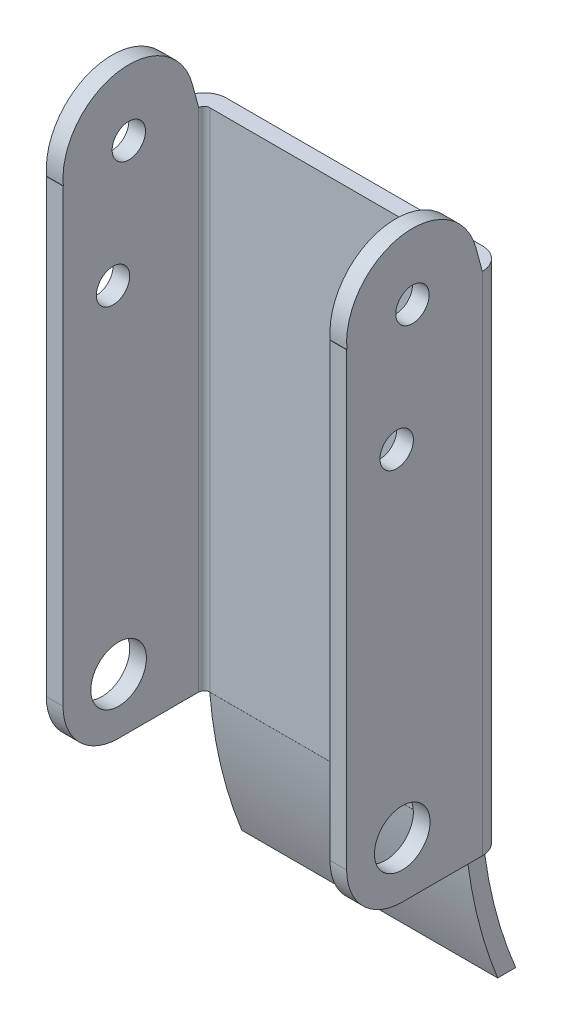
ISO-10303-21;
HEADER;
FILE_DESCRIPTION(('STEP AP214'),'2;1');
FILE_NAME('part.step','',(''),(''),'','','');
FILE_SCHEMA(('AUTOMOTIVE_DESIGN { 1 0 10303 214 1 1 1 1 }'));
ENDSEC;
DATA;
#1=APPLICATION_CONTEXT('core data for automotive mechanical design processes');
#2=APPLICATION_PROTOCOL_DEFINITION('international standard','automotive_design',2000,#1);
#3=PRODUCT_CONTEXT('',#1,'mechanical');
#4=PRODUCT('Part','Part','',(#3));
#5=PRODUCT_RELATED_PRODUCT_CATEGORY('part','',(#4));
#6=PRODUCT_DEFINITION_FORMATION('','',#4);
#7=PRODUCT_DEFINITION_CONTEXT('part definition',#1,'design');
#8=PRODUCT_DEFINITION('design','',#6,#7);
#9=PRODUCT_DEFINITION_SHAPE('','',#8);
#10=(LENGTH_UNIT() NAMED_UNIT(*) SI_UNIT(.MILLI.,.METRE.));
#11=(NAMED_UNIT(*) PLANE_ANGLE_UNIT() SI_UNIT($,.RADIAN.));
#12=(NAMED_UNIT(*) SI_UNIT($,.STERADIAN.) SOLID_ANGLE_UNIT());
#13=UNCERTAINTY_MEASURE_WITH_UNIT(LENGTH_MEASURE(1.E-05),#10,'distance_accuracy_value','');
#14=(GEOMETRIC_REPRESENTATION_CONTEXT(3) GLOBAL_UNCERTAINTY_ASSIGNED_CONTEXT((#13)) GLOBAL_UNIT_ASSIGNED_CONTEXT((#10,
#11,#12)) REPRESENTATION_CONTEXT('',''));
#15=CARTESIAN_POINT('',(0.,0.,0.));
#16=DIRECTION('',(0.,0.,1.));
#17=DIRECTION('',(1.,0.,0.));
#18=AXIS2_PLACEMENT_3D('',#15,#16,#17);
#19=CARTESIAN_POINT('',(12.,45.5,0.));
#20=DIRECTION('',(0.,-1.,0.));
#21=DIRECTION('',(0.,0.,-1.));
#22=AXIS2_PLACEMENT_3D('',#19,#20,#21);
#23=PLANE('',#22);
#24=DIRECTION('',(0.,0.,-1.));
#25=VECTOR('',#24,1.);
#26=CARTESIAN_POINT('',(12.,45.5,-0.014364686));
#27=LINE('',#26,#25);
#28=CARTESIAN_POINT('',(12.,45.4999999977813,0.));
#29=VERTEX_POINT('',#28);
#30=CARTESIAN_POINT('',(12.,45.4999999986152,-0.0287293726386772));
#31=VERTEX_POINT('',#30);
#32=EDGE_CURVE('E324',#29,#31,#27,.T.);
#33=ORIENTED_EDGE('',*,*,#32,.F.);
#34=DIRECTION('',(1.,0.,0.));
#35=VECTOR('',#34,1.);
#36=CARTESIAN_POINT('',(12.75,45.5,0.));
#37=LINE('',#36,#35);
#38=CARTESIAN_POINT('',(13.5,45.4999999977813,0.));
#39=VERTEX_POINT('',#38);
#40=EDGE_CURVE('E313',#29,#39,#37,.T.);
#41=ORIENTED_EDGE('',*,*,#40,.T.);
#42=DIRECTION('',(0.,0.,1.));
#43=VECTOR('',#42,1.);
#44=CARTESIAN_POINT('',(13.5,45.5,-0.014364686));
#45=LINE('',#44,#43);
#46=CARTESIAN_POINT('',(13.5,45.4999999986152,-0.0287293726386772));
#47=VERTEX_POINT('',#46);
#48=EDGE_CURVE('E157',#47,#39,#45,.T.);
#49=ORIENTED_EDGE('',*,*,#48,.F.);
#50=DIRECTION('',(1.,0.,0.));
#51=VECTOR('',#50,1.);
#52=CARTESIAN_POINT('',(12.75,45.4999999972305,-0.028729372775628));
#53=LINE('',#52,#51);
#54=EDGE_CURVE('E318',#47,#31,#53,.F.);
#55=ORIENTED_EDGE('',*,*,#54,.T.);
#56=EDGE_LOOP('',(#33,#41,#49,#55));
#57=FACE_BOUND('',#56,.T.);
#58=ADVANCED_FACE('F17',(#57),#23,.F.);
#59=CARTESIAN_POINT('',(12.,47.613989232,-11.633558293));
#60=DIRECTION('',(0.,-0.258819044879776,0.965925826348753));
#61=DIRECTION('',(0.,-0.965925826348753,-0.258819044879776));
#62=AXIS2_PLACEMENT_3D('',#59,#60,#61);
#63=PLANE('',#62);
#64=DIRECTION('',(0.,-0.965925826348753,-0.258819044879776));
#65=VECTOR('',#64,1.);
#66=CARTESIAN_POINT('',(12.,47.613989232,-11.633558293));
#67=LINE('',#66,#65);
#68=CARTESIAN_POINT('',(12.,45.5000000001913,-12.1999999999487));
#69=VERTEX_POINT('',#68);
#70=CARTESIAN_POINT('',(12.,47.6139892309188,-11.6335582929092));
#71=VERTEX_POINT('',#70);
#72=EDGE_CURVE('E386',#69,#71,#67,.F.);
#73=ORIENTED_EDGE('',*,*,#72,.T.);
#74=DIRECTION('',(-1.,0.,0.));
#75=VECTOR('',#74,1.);
#76=CARTESIAN_POINT('',(12.75,47.6139892320567,-11.6335582922238));
#77=LINE('',#76,#75);
#78=CARTESIAN_POINT('',(13.5,47.6139892309188,-11.6335582929092));
#79=VERTEX_POINT('',#78);
#80=EDGE_CURVE('E315',#71,#79,#77,.F.);
#81=ORIENTED_EDGE('',*,*,#80,.T.);
#82=DIRECTION('',(0.,-0.965925826348753,-0.258819044879776));
#83=VECTOR('',#82,1.);
#84=CARTESIAN_POINT('',(13.5,47.613989232,-11.633558293));
#85=LINE('',#84,#83);
#86=CARTESIAN_POINT('',(13.5,45.5000000007654,-12.1999999997949));
#87=VERTEX_POINT('',#86);
#88=EDGE_CURVE('E290',#79,#87,#85,.T.);
#89=ORIENTED_EDGE('',*,*,#88,.T.);
#90=DIRECTION('',(1.,0.,0.));
#91=VECTOR('',#90,1.);
#92=CARTESIAN_POINT('',(12.75,45.5,-12.2));
#93=LINE('',#92,#91);
#94=EDGE_CURVE('E321',#69,#87,#93,.T.);
#95=ORIENTED_EDGE('',*,*,#94,.F.);
#96=EDGE_LOOP('',(#73,#81,#89,#95));
#97=FACE_BOUND('',#96,.T.);
#98=ADVANCED_FACE('F424',(#97),#63,.F.);
#99=CARTESIAN_POINT('',(12.,46.082402226,-5.917597774));
#100=DIRECTION('',(1.,0.,0.));
#101=DIRECTION('',(0.,0.,-1.));
#102=AXIS2_PLACEMENT_3D('',#99,#100,#101);
#103=CYLINDRICAL_SURFACE('',#102,5.917597773);
#104=ORIENTED_EDGE('',*,*,#80,.F.);
#105=CARTESIAN_POINT('',(12.,46.082402226,-5.917597774));
#106=DIRECTION('',(1.,0.,0.));
#107=DIRECTION('',(0.,0.,-1.));
#108=AXIS2_PLACEMENT_3D('',#105,#106,#107);
#109=CIRCLE('',#108,5.917597773);
#110=EDGE_CURVE('E277',#71,#31,#109,.T.);
#111=ORIENTED_EDGE('',*,*,#110,.T.);
#112=ORIENTED_EDGE('',*,*,#54,.F.);
#113=CARTESIAN_POINT('',(13.5,46.082402226,-5.917597774));
#114=DIRECTION('',(1.,0.,0.));
#115=DIRECTION('',(0.,0.,-1.));
#116=AXIS2_PLACEMENT_3D('',#113,#114,#115);
#117=CIRCLE('',#116,5.917597773);
#118=EDGE_CURVE('E404',#47,#79,#117,.F.);
#119=ORIENTED_EDGE('',*,*,#118,.T.);
#120=EDGE_LOOP('',(#104,#111,#112,#119));
#121=FACE_BOUND('',#120,.T.);
#122=ADVANCED_FACE('F450',(#121),#103,.T.);
#123=CARTESIAN_POINT('',(13.5,5.,0.));
#124=DIRECTION('',(0.,0.,-1.));
#125=DIRECTION('',(-1.,0.,0.));
#126=AXIS2_PLACEMENT_3D('',#123,#124,#125);
#127=PLANE('',#126);
#128=DIRECTION('',(0.,1.,0.));
#129=VECTOR('',#128,1.);
#130=CARTESIAN_POINT('',(13.5,26.156,0.));
#131=LINE('',#130,#129);
#132=CARTESIAN_POINT('',(13.5,4.99999999897448,0.));
#133=VERTEX_POINT('',#132);
#134=EDGE_CURVE('E280',#133,#39,#131,.T.);
#135=ORIENTED_EDGE('',*,*,#134,.T.);
#136=ORIENTED_EDGE('',*,*,#40,.F.);
#137=DIRECTION('',(0.,-1.,0.));
#138=VECTOR('',#137,1.);
#139=CARTESIAN_POINT('',(12.,26.156,0.));
#140=LINE('',#139,#138);
#141=CARTESIAN_POINT('',(12.,4.99999999897448,0.));
#142=VERTEX_POINT('',#141);
#143=EDGE_CURVE('E274',#29,#142,#140,.T.);
#144=ORIENTED_EDGE('',*,*,#143,.T.);
#145=DIRECTION('',(-1.,0.,0.));
#146=VECTOR('',#145,1.);
#147=CARTESIAN_POINT('',(12.75,4.99999999794897,0.));
#148=LINE('',#147,#146);
#149=EDGE_CURVE('E310',#142,#133,#148,.F.);
#150=ORIENTED_EDGE('',*,*,#149,.T.);
#151=EDGE_LOOP('',(#135,#136,#144,#150));
#152=FACE_BOUND('',#151,.T.);
#153=ADVANCED_FACE('F448',(#152),#127,.F.);
#154=CARTESIAN_POINT('',(12.,5.,-5.));
#155=DIRECTION('',(1.,0.,0.));
#156=DIRECTION('',(0.,0.,-1.));
#157=AXIS2_PLACEMENT_3D('',#154,#155,#156);
#158=CYLINDRICAL_SURFACE('',#157,5.);
#159=CARTESIAN_POINT('',(12.,5.,-5.));
#160=DIRECTION('',(1.,0.,0.));
#161=DIRECTION('',(0.,0.,-1.));
#162=AXIS2_PLACEMENT_3D('',#159,#160,#161);
#163=CIRCLE('',#162,5.);
#164=CARTESIAN_POINT('',(12.,0.,-5.));
#165=VERTEX_POINT('',#164);
#166=EDGE_CURVE('E273',#142,#165,#163,.T.);
#167=ORIENTED_EDGE('',*,*,#166,.T.);
#168=DIRECTION('',(1.,0.,0.));
#169=VECTOR('',#168,1.);
#170=CARTESIAN_POINT('',(12.5,0.,-5.));
#171=LINE('',#170,#169);
#172=CARTESIAN_POINT('',(13.5,0.,-5.));
#173=VERTEX_POINT('',#172);
#174=EDGE_CURVE('E294',#165,#173,#171,.T.);
#175=ORIENTED_EDGE('',*,*,#174,.T.);
#176=CARTESIAN_POINT('',(13.5,5.,-5.));
#177=DIRECTION('',(1.,0.,0.));
#178=DIRECTION('',(0.,0.,-1.));
#179=AXIS2_PLACEMENT_3D('',#176,#177,#178);
#180=CIRCLE('',#179,5.);
#181=EDGE_CURVE('E284',#173,#133,#180,.F.);
#182=ORIENTED_EDGE('',*,*,#181,.T.);
#183=ORIENTED_EDGE('',*,*,#149,.F.);
#184=EDGE_LOOP('',(#167,#175,#182,#183));
#185=FACE_BOUND('',#184,.T.);
#186=ADVANCED_FACE('F444',(#185),#158,.T.);
#187=CARTESIAN_POINT('',(12.,35.5,-4.5));
#188=DIRECTION('',(1.,0.,0.));
#189=DIRECTION('',(0.,0.,-1.));
#190=AXIS2_PLACEMENT_3D('',#187,#188,#189);
#191=CYLINDRICAL_SURFACE('',#190,1.5);
#192=CARTESIAN_POINT('',(12.,35.5,-4.5));
#193=DIRECTION('',(1.,0.,0.));
#194=DIRECTION('',(0.,0.,-1.));
#195=AXIS2_PLACEMENT_3D('',#192,#193,#194);
#196=CIRCLE('',#195,1.5);
#197=CARTESIAN_POINT('',(12.,35.5,-6.));
#198=VERTEX_POINT('',#197);
#199=EDGE_CURVE('E272',#198,#198,#196,.F.);
#200=ORIENTED_EDGE('',*,*,#199,.T.);
#201=EDGE_LOOP('',(#200));
#202=FACE_BOUND('',#201,.T.);
#203=CARTESIAN_POINT('',(13.5,35.5,-4.5));
#204=DIRECTION('',(1.,0.,0.));
#205=DIRECTION('',(0.,0.,-1.));
#206=AXIS2_PLACEMENT_3D('',#203,#204,#205);
#207=CIRCLE('',#206,1.5);
#208=CARTESIAN_POINT('',(13.5,35.5,-6.));
#209=VERTEX_POINT('',#208);
#210=EDGE_CURVE('E283',#209,#209,#207,.T.);
#211=ORIENTED_EDGE('',*,*,#210,.T.);
#212=EDGE_LOOP('',(#211));
#213=FACE_BOUND('',#212,.T.);
#214=ADVANCED_FACE('F521',(#202,#213),#191,.F.);
#215=CARTESIAN_POINT('',(12.,46.082402226,-5.917597774));
#216=DIRECTION('',(1.,0.,0.));
#217=DIRECTION('',(0.,0.,-1.));
#218=AXIS2_PLACEMENT_3D('',#215,#216,#217);
#219=CYLINDRICAL_SURFACE('',#218,1.5);
#220=CARTESIAN_POINT('',(12.,46.082402226,-5.917597774));
#221=DIRECTION('',(1.,0.,0.));
#222=DIRECTION('',(0.,0.,-1.));
#223=AXIS2_PLACEMENT_3D('',#220,#221,#222);
#224=CIRCLE('',#223,1.5);
#225=CARTESIAN_POINT('',(12.,46.082402226,-7.417597774));
#226=VERTEX_POINT('',#225);
#227=EDGE_CURVE('E377',#226,#226,#224,.F.);
#228=ORIENTED_EDGE('',*,*,#227,.T.);
#229=EDGE_LOOP('',(#228));
#230=FACE_BOUND('',#229,.T.);
#231=CARTESIAN_POINT('',(13.5,46.082402226,-5.917597774));
#232=DIRECTION('',(1.,0.,0.));
#233=DIRECTION('',(0.,0.,-1.));
#234=AXIS2_PLACEMENT_3D('',#231,#232,#233);
#235=CIRCLE('',#234,1.5);
#236=CARTESIAN_POINT('',(13.5,46.082402226,-7.417597774));
#237=VERTEX_POINT('',#236);
#238=EDGE_CURVE('E396',#237,#237,#235,.T.);
#239=ORIENTED_EDGE('',*,*,#238,.T.);
#240=EDGE_LOOP('',(#239));
#241=FACE_BOUND('',#240,.T.);
#242=ADVANCED_FACE('F517',(#230,#241),#219,.F.);
#243=CARTESIAN_POINT('',(12.,5.,-5.));
#244=DIRECTION('',(1.,0.,0.));
#245=DIRECTION('',(0.,0.,-1.));
#246=AXIS2_PLACEMENT_3D('',#243,#244,#245);
#247=CYLINDRICAL_SURFACE('',#246,2.5);
#248=CARTESIAN_POINT('',(12.,5.,-5.));
#249=DIRECTION('',(1.,0.,0.));
#250=DIRECTION('',(0.,0.,-1.));
#251=AXIS2_PLACEMENT_3D('',#248,#249,#250);
#252=CIRCLE('',#251,2.5);
#253=CARTESIAN_POINT('',(12.,5.,-7.5));
#254=VERTEX_POINT('',#253);
#255=EDGE_CURVE('E302',#254,#254,#252,.F.);
#256=ORIENTED_EDGE('',*,*,#255,.T.);
#257=EDGE_LOOP('',(#256));
#258=FACE_BOUND('',#257,.T.);
#259=CARTESIAN_POINT('',(13.5,5.,-5.));
#260=DIRECTION('',(1.,0.,0.));
#261=DIRECTION('',(0.,0.,-1.));
#262=AXIS2_PLACEMENT_3D('',#259,#260,#261);
#263=CIRCLE('',#262,2.5);
#264=CARTESIAN_POINT('',(13.5,5.,-7.5));
#265=VERTEX_POINT('',#264);
#266=EDGE_CURVE('E393',#265,#265,#263,.T.);
#267=ORIENTED_EDGE('',*,*,#266,.T.);
#268=EDGE_LOOP('',(#267));
#269=FACE_BOUND('',#268,.T.);
#270=ADVANCED_FACE('F513',(#258,#269),#247,.F.);
#271=CARTESIAN_POINT('',(-11.5,-12.2,-17.200004735));
#272=DIRECTION('',(0.,1.,0.));
#273=DIRECTION('',(0.,0.,1.));
#274=AXIS2_PLACEMENT_3D('',#271,#272,#273);
#275=PLANE('',#274);
#276=DIRECTION('',(0.,0.,-1.));
#277=VECTOR('',#276,1.);
#278=CARTESIAN_POINT('',(-11.5,-12.2,-14.9473251035));
#279=LINE('',#278,#277);
#280=CARTESIAN_POINT('',(-11.5,-12.2000000034895,-15.5790039200872));
#281=VERTEX_POINT('',#280);
#282=CARTESIAN_POINT('',(-11.5,-12.2000000067506,-17.2000047378064));
#283=VERTEX_POINT('',#282);
#284=EDGE_CURVE('E298',#281,#283,#279,.T.);
#285=ORIENTED_EDGE('',*,*,#284,.T.);
#286=DIRECTION('',(1.,0.,0.));
#287=VECTOR('',#286,1.);
#288=CARTESIAN_POINT('',(0.,-12.2000000135012,-17.2000047406313));
#289=LINE('',#288,#287);
#290=CARTESIAN_POINT('',(11.5,-12.2000000067506,-17.2000047378064));
#291=VERTEX_POINT('',#290);
#292=EDGE_CURVE('E299',#291,#283,#289,.F.);
#293=ORIENTED_EDGE('',*,*,#292,.F.);
#294=DIRECTION('',(0.,0.,-1.));
#295=VECTOR('',#294,1.);
#296=CARTESIAN_POINT('',(11.5,-12.2,-14.9473251035));
#297=LINE('',#296,#295);
#298=CARTESIAN_POINT('',(11.5,-12.2000000034895,-15.5790039200872));
#299=VERTEX_POINT('',#298);
#300=EDGE_CURVE('E295',#299,#291,#297,.T.);
#301=ORIENTED_EDGE('',*,*,#300,.F.);
#302=DIRECTION('',(1.,0.,0.));
#303=VECTOR('',#302,1.);
#304=CARTESIAN_POINT('',(0.,-12.2000000069791,-15.5790039214869));
#305=LINE('',#304,#303);
#306=EDGE_CURVE('E325',#299,#281,#305,.F.);
#307=ORIENTED_EDGE('',*,*,#306,.T.);
#308=EDGE_LOOP('',(#285,#293,#301,#307));
#309=FACE_BOUND('',#308,.T.);
#310=ADVANCED_FACE('F516',(#309),#275,.F.);
#311=CARTESIAN_POINT('',(-11.5,-12.2,-12.667613316));
#312=DIRECTION('',(1.,0.,0.));
#313=DIRECTION('',(0.,0.,-1.));
#314=AXIS2_PLACEMENT_3D('',#311,#312,#313);
#315=PLANE('',#314);
#316=ORIENTED_EDGE('',*,*,#284,.F.);
#317=CARTESIAN_POINT('',(-11.5,3.487116128,-54.687546416));
#318=DIRECTION('',(-1.,0.,0.));
#319=DIRECTION('',(0.,0.,1.));
#320=AXIS2_PLACEMENT_3D('',#317,#318,#319);
#321=CIRCLE('',#320,42.137438326);
#322=CARTESIAN_POINT('',(-11.5,0.,-12.6946454709362));
#323=VERTEX_POINT('',#322);
#324=EDGE_CURVE('E328',#281,#323,#321,.T.);
#325=ORIENTED_EDGE('',*,*,#324,.T.);
#326=DIRECTION('',(0.,0.,1.));
#327=VECTOR('',#326,1.);
#328=CARTESIAN_POINT('',(-11.5,0.,-14.9473251035));
#329=LINE('',#328,#327);
#330=CARTESIAN_POINT('',(-11.5000000000449,0.,-12.7000000002372));
#331=VERTEX_POINT('',#330);
#332=EDGE_CURVE('E305',#331,#323,#329,.T.);
#333=ORIENTED_EDGE('',*,*,#332,.F.);
#334=DIRECTION('',(0.,0.,1.));
#335=VECTOR('',#334,1.);
#336=CARTESIAN_POINT('',(-11.5,0.,-14.9473251035));
#337=LINE('',#336,#335);
#338=CARTESIAN_POINT('',(-11.5000000001796,-1.79756621913885E-09,-14.2000000000218));
#339=VERTEX_POINT('',#338);
#340=EDGE_CURVE('E307',#339,#331,#337,.T.);
#341=ORIENTED_EDGE('',*,*,#340,.F.);
#342=CARTESIAN_POINT('',(-11.5,3.487116128,-54.687546416));
#343=DIRECTION('',(-1.,0.,0.));
#344=DIRECTION('',(0.,0.,1.));
#345=AXIS2_PLACEMENT_3D('',#342,#343,#344);
#346=CIRCLE('',#345,40.637438326);
#347=EDGE_CURVE('E301',#283,#339,#346,.T.);
#348=ORIENTED_EDGE('',*,*,#347,.F.);
#349=EDGE_LOOP('',(#316,#325,#333,#341,#348));
#350=FACE_BOUND('',#349,.T.);
#351=ADVANCED_FACE('F550',(#350),#315,.F.);
#352=CARTESIAN_POINT('',(11.5,-12.2,-12.667613316));
#353=DIRECTION('',(1.,0.,0.));
#354=DIRECTION('',(0.,0.,-1.));
#355=AXIS2_PLACEMENT_3D('',#352,#353,#354);
#356=PLANE('',#355);
#357=CARTESIAN_POINT('',(11.5,3.487116128,-54.687546416));
#358=DIRECTION('',(-1.,0.,0.));
#359=DIRECTION('',(0.,0.,1.));
#360=AXIS2_PLACEMENT_3D('',#357,#358,#359);
#361=CIRCLE('',#360,42.137438326);
#362=CARTESIAN_POINT('',(11.5,0.,-12.6946454709362));
#363=VERTEX_POINT('',#362);
#364=EDGE_CURVE('E329',#363,#299,#361,.F.);
#365=ORIENTED_EDGE('',*,*,#364,.T.);
#366=ORIENTED_EDGE('',*,*,#300,.T.);
#367=CARTESIAN_POINT('',(11.5,3.487116128,-54.687546416));
#368=DIRECTION('',(-1.,0.,0.));
#369=DIRECTION('',(0.,0.,1.));
#370=AXIS2_PLACEMENT_3D('',#367,#368,#369);
#371=CIRCLE('',#370,40.637438326);
#372=CARTESIAN_POINT('',(11.5,-1.54434559758443E-09,-14.199999999867));
#373=VERTEX_POINT('',#372);
#374=EDGE_CURVE('E370',#373,#291,#371,.F.);
#375=ORIENTED_EDGE('',*,*,#374,.F.);
#376=DIRECTION('',(0.,0.,1.));
#377=VECTOR('',#376,1.);
#378=CARTESIAN_POINT('',(11.5,0.,-9.6276));
#379=LINE('',#378,#377);
#380=CARTESIAN_POINT('',(11.5,0.,-12.7000000002372));
#381=VERTEX_POINT('',#380);
#382=EDGE_CURVE('E291',#373,#381,#379,.T.);
#383=ORIENTED_EDGE('',*,*,#382,.T.);
#384=DIRECTION('',(0.,0.,1.));
#385=VECTOR('',#384,1.);
#386=CARTESIAN_POINT('',(11.5,0.,-14.9473251035));
#387=LINE('',#386,#385);
#388=EDGE_CURVE('E151',#381,#363,#387,.T.);
#389=ORIENTED_EDGE('',*,*,#388,.T.);
#390=EDGE_LOOP('',(#365,#366,#375,#383,#389));
#391=FACE_BOUND('',#390,.T.);
#392=ADVANCED_FACE('F434',(#391),#356,.T.);
#393=CARTESIAN_POINT('',(11.5,0.,-14.2552));
#394=DIRECTION('',(0.,1.,0.));
#395=DIRECTION('',(0.,0.,1.));
#396=AXIS2_PLACEMENT_3D('',#393,#394,#395);
#397=PLANE('',#396);
#398=ORIENTED_EDGE('',*,*,#382,.F.);
#399=CARTESIAN_POINT('',(11.5,0.,-12.2));
#400=DIRECTION('',(0.,-1.,0.));
#401=DIRECTION('',(0.,0.,-1.));
#402=AXIS2_PLACEMENT_3D('',#399,#400,#401);
#403=CIRCLE('',#402,2.);
#404=CARTESIAN_POINT('',(13.5,0.,-12.1999999997949));
#405=VERTEX_POINT('',#404);
#406=EDGE_CURVE('E268',#373,#405,#403,.T.);
#407=ORIENTED_EDGE('',*,*,#406,.T.);
#408=DIRECTION('',(0.,0.,1.));
#409=VECTOR('',#408,1.);
#410=CARTESIAN_POINT('',(13.5,0.,-6.039));
#411=LINE('',#410,#409);
#412=EDGE_CURVE('E287',#405,#173,#411,.T.);
#413=ORIENTED_EDGE('',*,*,#412,.T.);
#414=ORIENTED_EDGE('',*,*,#174,.F.);
#415=DIRECTION('',(0.,0.,-1.));
#416=VECTOR('',#415,1.);
#417=CARTESIAN_POINT('',(12.,0.,-6.039));
#418=LINE('',#417,#416);
#419=CARTESIAN_POINT('',(12.,0.,-12.1999999999487));
#420=VERTEX_POINT('',#419);
#421=EDGE_CURVE('E269',#165,#420,#418,.T.);
#422=ORIENTED_EDGE('',*,*,#421,.T.);
#423=CARTESIAN_POINT('',(11.5,0.,-12.2));
#424=DIRECTION('',(0.,-1.,0.));
#425=DIRECTION('',(0.,0.,-1.));
#426=AXIS2_PLACEMENT_3D('',#423,#424,#425);
#427=CIRCLE('',#426,0.5);
#428=EDGE_CURVE('E21',#381,#420,#427,.T.);
#429=ORIENTED_EDGE('',*,*,#428,.F.);
#430=EDGE_LOOP('',(#398,#407,#413,#414,#422,#429));
#431=FACE_BOUND('',#430,.T.);
#432=ADVANCED_FACE('F417',(#431),#397,.F.);
#433=CARTESIAN_POINT('',(13.5,0.,-12.2));
#434=DIRECTION('',(-1.,0.,0.));
#435=DIRECTION('',(0.,0.,1.));
#436=AXIS2_PLACEMENT_3D('',#433,#434,#435);
#437=PLANE('',#436);
#438=ORIENTED_EDGE('',*,*,#266,.F.);
#439=EDGE_LOOP('',(#438));
#440=FACE_BOUND('',#439,.T.);
#441=ORIENTED_EDGE('',*,*,#238,.F.);
#442=EDGE_LOOP('',(#441));
#443=FACE_BOUND('',#442,.T.);
#444=ORIENTED_EDGE('',*,*,#210,.F.);
#445=EDGE_LOOP('',(#444));
#446=FACE_BOUND('',#445,.T.);
#447=ORIENTED_EDGE('',*,*,#181,.F.);
#448=ORIENTED_EDGE('',*,*,#412,.F.);
#449=DIRECTION('',(0.,-1.,0.));
#450=VECTOR('',#449,1.);
#451=CARTESIAN_POINT('',(13.5,22.75,-12.1999999995898));
#452=LINE('',#451,#450);
#453=EDGE_CURVE('E265',#405,#87,#452,.F.);
#454=ORIENTED_EDGE('',*,*,#453,.T.);
#455=ORIENTED_EDGE('',*,*,#88,.F.);
#456=ORIENTED_EDGE('',*,*,#118,.F.);
#457=ORIENTED_EDGE('',*,*,#48,.T.);
#458=ORIENTED_EDGE('',*,*,#134,.F.);
#459=EDGE_LOOP('',(#447,#448,#454,#455,#456,#457,#458));
#460=FACE_BOUND('',#459,.T.);
#461=ADVANCED_FACE('F442',(#440,#443,#446,#460),#437,.F.);
#462=CARTESIAN_POINT('',(11.5,3.487116128,-54.687546416));
#463=DIRECTION('',(-1.,0.,0.));
#464=DIRECTION('',(0.,0.,1.));
#465=AXIS2_PLACEMENT_3D('',#462,#463,#464);
#466=CYLINDRICAL_SURFACE('',#465,42.137438326);
#467=ORIENTED_EDGE('',*,*,#324,.F.);
#468=ORIENTED_EDGE('',*,*,#306,.F.);
#469=ORIENTED_EDGE('',*,*,#364,.F.);
#470=DIRECTION('',(-1.,0.,0.));
#471=VECTOR('',#470,1.);
#472=CARTESIAN_POINT('',(0.,0.,-12.694645471));
#473=LINE('',#472,#471);
#474=EDGE_CURVE('E264',#363,#323,#473,.T.);
#475=ORIENTED_EDGE('',*,*,#474,.T.);
#476=EDGE_LOOP('',(#467,#468,#469,#475));
#477=FACE_BOUND('',#476,.T.);
#478=ADVANCED_FACE('F509',(#477),#466,.T.);
#479=CARTESIAN_POINT('',(12.,0.,0.122));
#480=DIRECTION('',(1.,0.,0.));
#481=DIRECTION('',(0.,0.,-1.));
#482=AXIS2_PLACEMENT_3D('',#479,#480,#481);
#483=PLANE('',#482);
#484=ORIENTED_EDGE('',*,*,#255,.F.);
#485=EDGE_LOOP('',(#484));
#486=FACE_BOUND('',#485,.T.);
#487=ORIENTED_EDGE('',*,*,#227,.F.);
#488=EDGE_LOOP('',(#487));
#489=FACE_BOUND('',#488,.T.);
#490=ORIENTED_EDGE('',*,*,#199,.F.);
#491=EDGE_LOOP('',(#490));
#492=FACE_BOUND('',#491,.T.);
#493=ORIENTED_EDGE('',*,*,#166,.F.);
#494=ORIENTED_EDGE('',*,*,#143,.F.);
#495=ORIENTED_EDGE('',*,*,#32,.T.);
#496=ORIENTED_EDGE('',*,*,#110,.F.);
#497=ORIENTED_EDGE('',*,*,#72,.F.);
#498=DIRECTION('',(0.,-1.,0.));
#499=VECTOR('',#498,1.);
#500=CARTESIAN_POINT('',(12.,22.75,-12.1999999998975));
#501=LINE('',#500,#499);
#502=EDGE_CURVE('E256',#420,#69,#501,.F.);
#503=ORIENTED_EDGE('',*,*,#502,.F.);
#504=ORIENTED_EDGE('',*,*,#421,.F.);
#505=EDGE_LOOP('',(#493,#494,#495,#496,#497,#503,#504));
#506=FACE_BOUND('',#505,.T.);
#507=ADVANCED_FACE('F421',(#486,#489,#492,#506),#483,.F.);
#508=CARTESIAN_POINT('',(11.5,3.487116128,-54.687546416));
#509=DIRECTION('',(-1.,0.,0.));
#510=DIRECTION('',(0.,0.,1.));
#511=AXIS2_PLACEMENT_3D('',#508,#509,#510);
#512=CYLINDRICAL_SURFACE('',#511,40.637438326);
#513=DIRECTION('',(1.,0.,0.));
#514=VECTOR('',#513,1.);
#515=CARTESIAN_POINT('',(0.,0.,-14.2));
#516=LINE('',#515,#514);
#517=EDGE_CURVE('E252',#339,#373,#516,.T.);
#518=ORIENTED_EDGE('',*,*,#517,.T.);
#519=ORIENTED_EDGE('',*,*,#374,.T.);
#520=ORIENTED_EDGE('',*,*,#292,.T.);
#521=ORIENTED_EDGE('',*,*,#347,.T.);
#522=EDGE_LOOP('',(#518,#519,#520,#521));
#523=FACE_BOUND('',#522,.T.);
#524=ADVANCED_FACE('F505',(#523),#512,.F.);
#525=CARTESIAN_POINT('',(11.5,45.5,-12.2));
#526=DIRECTION('',(0.,-1.,0.));
#527=DIRECTION('',(0.,0.,-1.));
#528=AXIS2_PLACEMENT_3D('',#525,#526,#527);
#529=CYLINDRICAL_SURFACE('',#528,2.);
#530=CARTESIAN_POINT('',(11.5,45.5,-12.2));
#531=DIRECTION('',(0.,-1.,0.));
#532=DIRECTION('',(0.,0.,-1.));
#533=AXIS2_PLACEMENT_3D('',#530,#531,#532);
#534=CIRCLE('',#533,2.);
#535=CARTESIAN_POINT('',(11.5,45.5,-14.2));
#536=VERTEX_POINT('',#535);
#537=EDGE_CURVE('E261',#536,#87,#534,.T.);
#538=ORIENTED_EDGE('',*,*,#537,.T.);
#539=ORIENTED_EDGE('',*,*,#453,.F.);
#540=ORIENTED_EDGE('',*,*,#406,.F.);
#541=DIRECTION('',(0.,1.,0.));
#542=VECTOR('',#541,1.);
#543=CARTESIAN_POINT('',(11.5,22.75,-14.2));
#544=LINE('',#543,#542);
#545=EDGE_CURVE('E255',#373,#536,#544,.T.);
#546=ORIENTED_EDGE('',*,*,#545,.T.);
#547=EDGE_LOOP('',(#538,#539,#540,#546));
#548=FACE_BOUND('',#547,.T.);
#549=ADVANCED_FACE('F440',(#548),#529,.T.);
#550=CARTESIAN_POINT('',(-11.5,0.,-12.694645471));
#551=DIRECTION('',(0.,-1.,0.));
#552=DIRECTION('',(0.,0.,-1.));
#553=AXIS2_PLACEMENT_3D('',#550,#551,#552);
#554=PLANE('',#553);
#555=DIRECTION('',(-1.,0.,0.));
#556=VECTOR('',#555,1.);
#557=CARTESIAN_POINT('',(0.,0.,-12.7));
#558=LINE('',#557,#556);
#559=EDGE_CURVE('E241',#381,#331,#558,.T.);
#560=ORIENTED_EDGE('',*,*,#559,.T.);
#561=ORIENTED_EDGE('',*,*,#332,.T.);
#562=ORIENTED_EDGE('',*,*,#474,.F.);
#563=ORIENTED_EDGE('',*,*,#388,.F.);
#564=EDGE_LOOP('',(#560,#561,#562,#563));
#565=FACE_BOUND('',#564,.T.);
#566=ADVANCED_FACE('F502',(#565),#554,.F.);
#567=CARTESIAN_POINT('',(11.5,45.5,-12.2));
#568=DIRECTION('',(0.,-1.,0.));
#569=DIRECTION('',(0.,0.,-1.));
#570=AXIS2_PLACEMENT_3D('',#567,#568,#569);
#571=CYLINDRICAL_SURFACE('',#570,0.5);
#572=DIRECTION('',(0.,-1.,0.));
#573=VECTOR('',#572,1.);
#574=CARTESIAN_POINT('',(11.5,22.75,-12.7));
#575=LINE('',#574,#573);
#576=CARTESIAN_POINT('',(11.5,45.5,-12.7));
#577=VERTEX_POINT('',#576);
#578=EDGE_CURVE('E231',#577,#381,#575,.T.);
#579=ORIENTED_EDGE('',*,*,#578,.T.);
#580=ORIENTED_EDGE('',*,*,#428,.T.);
#581=ORIENTED_EDGE('',*,*,#502,.T.);
#582=CARTESIAN_POINT('',(11.5,45.5,-12.2));
#583=DIRECTION('',(0.,-1.,0.));
#584=DIRECTION('',(0.,0.,-1.));
#585=AXIS2_PLACEMENT_3D('',#582,#583,#584);
#586=CIRCLE('',#585,0.5);
#587=EDGE_CURVE('E364',#69,#577,#586,.F.);
#588=ORIENTED_EDGE('',*,*,#587,.T.);
#589=EDGE_LOOP('',(#579,#580,#581,#588));
#590=FACE_BOUND('',#589,.T.);
#591=ADVANCED_FACE('F410',(#590),#571,.F.);
#592=CARTESIAN_POINT('',(-11.5,0.,-14.2));
#593=DIRECTION('',(0.,0.,1.));
#594=DIRECTION('',(1.,0.,0.));
#595=AXIS2_PLACEMENT_3D('',#592,#593,#594);
#596=PLANE('',#595);
#597=DIRECTION('',(1.,0.,0.));
#598=VECTOR('',#597,1.);
#599=CARTESIAN_POINT('',(0.,45.5,-14.2));
#600=LINE('',#599,#598);
#601=CARTESIAN_POINT('',(-11.5000000001796,45.5,-14.2));
#602=VERTEX_POINT('',#601);
#603=EDGE_CURVE('E244',#602,#536,#600,.T.);
#604=ORIENTED_EDGE('',*,*,#603,.T.);
#605=ORIENTED_EDGE('',*,*,#545,.F.);
#606=ORIENTED_EDGE('',*,*,#517,.F.);
#607=DIRECTION('',(0.,-1.,0.));
#608=VECTOR('',#607,1.);
#609=CARTESIAN_POINT('',(-11.5000000003592,22.75,-14.2));
#610=LINE('',#609,#608);
#611=EDGE_CURVE('E178',#339,#602,#610,.F.);
#612=ORIENTED_EDGE('',*,*,#611,.T.);
#613=EDGE_LOOP('',(#604,#605,#606,#612));
#614=FACE_BOUND('',#613,.T.);
#615=ADVANCED_FACE('F501',(#614),#596,.F.);
#616=CARTESIAN_POINT('',(-13.662,45.5,-12.2));
#617=DIRECTION('',(0.,-1.,0.));
#618=DIRECTION('',(0.,0.,-1.));
#619=AXIS2_PLACEMENT_3D('',#616,#617,#618);
#620=PLANE('',#619);
#621=CARTESIAN_POINT('',(-11.5,45.5,-12.2));
#622=DIRECTION('',(0.,-1.,0.));
#623=DIRECTION('',(0.,0.,-1.));
#624=AXIS2_PLACEMENT_3D('',#621,#622,#623);
#625=CIRCLE('',#624,2.);
#626=CARTESIAN_POINT('',(-13.5,45.5,-12.1999999996153));
#627=VERTEX_POINT('',#626);
#628=EDGE_CURVE('E226',#602,#627,#625,.F.);
#629=ORIENTED_EDGE('',*,*,#628,.T.);
#630=DIRECTION('',(-1.,0.,0.));
#631=VECTOR('',#630,1.);
#632=CARTESIAN_POINT('',(0.,45.5,-12.2));
#633=LINE('',#632,#631);
#634=CARTESIAN_POINT('',(-12.,45.5,-12.2));
#635=VERTEX_POINT('',#634);
#636=EDGE_CURVE('E249',#635,#627,#633,.T.);
#637=ORIENTED_EDGE('',*,*,#636,.F.);
#638=CARTESIAN_POINT('',(-11.5,45.5,-12.2));
#639=DIRECTION('',(0.,-1.,0.));
#640=DIRECTION('',(0.,0.,-1.));
#641=AXIS2_PLACEMENT_3D('',#638,#639,#640);
#642=CIRCLE('',#641,0.5);
#643=CARTESIAN_POINT('',(-11.5000000000449,45.5,-12.7));
#644=VERTEX_POINT('',#643);
#645=EDGE_CURVE('E251',#644,#635,#642,.F.);
#646=ORIENTED_EDGE('',*,*,#645,.F.);
#647=DIRECTION('',(1.,0.,0.));
#648=VECTOR('',#647,1.);
#649=CARTESIAN_POINT('',(0.,45.5,-12.7));
#650=LINE('',#649,#648);
#651=EDGE_CURVE('E243',#644,#577,#650,.T.);
#652=ORIENTED_EDGE('',*,*,#651,.T.);
#653=ORIENTED_EDGE('',*,*,#587,.F.);
#654=ORIENTED_EDGE('',*,*,#94,.T.);
#655=ORIENTED_EDGE('',*,*,#537,.F.);
#656=ORIENTED_EDGE('',*,*,#603,.F.);
#657=EDGE_LOOP('',(#629,#637,#646,#652,#653,#654,#655,#656));
#658=FACE_BOUND('',#657,.T.);
#659=ADVANCED_FACE('F427',(#658),#620,.F.);
#660=CARTESIAN_POINT('',(11.5,0.,-12.7));
#661=DIRECTION('',(0.,0.,-1.));
#662=DIRECTION('',(-1.,0.,0.));
#663=AXIS2_PLACEMENT_3D('',#660,#661,#662);
#664=PLANE('',#663);
#665=ORIENTED_EDGE('',*,*,#651,.F.);
#666=DIRECTION('',(0.,-1.,0.));
#667=VECTOR('',#666,1.);
#668=CARTESIAN_POINT('',(-11.5000000000898,22.75,-12.7));
#669=LINE('',#668,#667);
#670=EDGE_CURVE('E223',#331,#644,#669,.F.);
#671=ORIENTED_EDGE('',*,*,#670,.F.);
#672=ORIENTED_EDGE('',*,*,#559,.F.);
#673=ORIENTED_EDGE('',*,*,#578,.F.);
#674=EDGE_LOOP('',(#665,#671,#672,#673));
#675=FACE_BOUND('',#674,.T.);
#676=ADVANCED_FACE('F430',(#675),#664,.F.);
#677=CARTESIAN_POINT('',(-13.5,45.5,0.));
#678=DIRECTION('',(0.,-1.,0.));
#679=DIRECTION('',(0.,0.,-1.));
#680=AXIS2_PLACEMENT_3D('',#677,#678,#679);
#681=PLANE('',#680);
#682=DIRECTION('',(0.,0.,1.));
#683=VECTOR('',#682,1.);
#684=CARTESIAN_POINT('',(-12.,45.5,-0.014364686));
#685=LINE('',#684,#683);
#686=CARTESIAN_POINT('',(-12.,45.4999999986152,-0.0287293726386772));
#687=VERTEX_POINT('',#686);
#688=CARTESIAN_POINT('',(-12.,45.4999999977813,0.));
#689=VERTEX_POINT('',#688);
#690=EDGE_CURVE('E167',#687,#689,#685,.T.);
#691=ORIENTED_EDGE('',*,*,#690,.F.);
#692=DIRECTION('',(1.,0.,0.));
#693=VECTOR('',#692,1.);
#694=CARTESIAN_POINT('',(-12.75,45.4999999972305,-0.028729372775628));
#695=LINE('',#694,#693);
#696=CARTESIAN_POINT('',(-13.5,45.4999999986152,-0.0287293726386772));
#697=VERTEX_POINT('',#696);
#698=EDGE_CURVE('E224',#687,#697,#695,.F.);
#699=ORIENTED_EDGE('',*,*,#698,.T.);
#700=DIRECTION('',(0.,0.,-1.));
#701=VECTOR('',#700,1.);
#702=CARTESIAN_POINT('',(-13.5,45.5,-0.014364686));
#703=LINE('',#702,#701);
#704=CARTESIAN_POINT('',(-13.5,45.4999999977813,0.));
#705=VERTEX_POINT('',#704);
#706=EDGE_CURVE('E179',#705,#697,#703,.T.);
#707=ORIENTED_EDGE('',*,*,#706,.F.);
#708=DIRECTION('',(1.,0.,0.));
#709=VECTOR('',#708,1.);
#710=CARTESIAN_POINT('',(-12.75,45.5,0.));
#711=LINE('',#710,#709);
#712=EDGE_CURVE('E182',#705,#689,#711,.T.);
#713=ORIENTED_EDGE('',*,*,#712,.T.);
#714=EDGE_LOOP('',(#691,#699,#707,#713));
#715=FACE_BOUND('',#714,.T.);
#716=ADVANCED_FACE('F183',(#715),#681,.F.);
#717=CARTESIAN_POINT('',(-11.5,45.5,-12.2));
#718=DIRECTION('',(0.,-1.,0.));
#719=DIRECTION('',(0.,0.,-1.));
#720=AXIS2_PLACEMENT_3D('',#717,#718,#719);
#721=CYLINDRICAL_SURFACE('',#720,2.);
#722=ORIENTED_EDGE('',*,*,#628,.F.);
#723=ORIENTED_EDGE('',*,*,#611,.F.);
#724=CARTESIAN_POINT('',(-11.5,0.,-12.2));
#725=DIRECTION('',(0.,-1.,0.));
#726=DIRECTION('',(0.,0.,-1.));
#727=AXIS2_PLACEMENT_3D('',#724,#725,#726);
#728=CIRCLE('',#727,2.);
#729=CARTESIAN_POINT('',(-13.5,0.,-12.2));
#730=VERTEX_POINT('',#729);
#731=EDGE_CURVE('E238',#339,#730,#728,.F.);
#732=ORIENTED_EDGE('',*,*,#731,.T.);
#733=DIRECTION('',(0.,1.,0.));
#734=VECTOR('',#733,1.);
#735=CARTESIAN_POINT('',(-13.5,26.156,-12.2));
#736=LINE('',#735,#734);
#737=EDGE_CURVE('E212',#730,#627,#736,.T.);
#738=ORIENTED_EDGE('',*,*,#737,.T.);
#739=EDGE_LOOP('',(#722,#723,#732,#738));
#740=FACE_BOUND('',#739,.T.);
#741=ADVANCED_FACE('F494',(#740),#721,.T.);
#742=CARTESIAN_POINT('',(-13.5,46.082402226,-5.917597774));
#743=DIRECTION('',(1.,0.,0.));
#744=DIRECTION('',(0.,1.,0.));
#745=AXIS2_PLACEMENT_3D('',#742,#743,#744);
#746=CYLINDRICAL_SURFACE('',#745,5.917597773);
#747=ORIENTED_EDGE('',*,*,#698,.F.);
#748=CARTESIAN_POINT('',(-12.,46.082402226,-5.917597774));
#749=DIRECTION('',(1.,0.,0.));
#750=DIRECTION('',(0.,1.,0.));
#751=AXIS2_PLACEMENT_3D('',#748,#749,#750);
#752=CIRCLE('',#751,5.917597773);
#753=CARTESIAN_POINT('',(-12.,47.6139892308904,-11.6335582932973));
#754=VERTEX_POINT('',#753);
#755=EDGE_CURVE('E174',#687,#754,#752,.F.);
#756=ORIENTED_EDGE('',*,*,#755,.T.);
#757=DIRECTION('',(-1.,0.,0.));
#758=VECTOR('',#757,1.);
#759=CARTESIAN_POINT('',(-12.75,47.613989232,-11.633558293));
#760=LINE('',#759,#758);
#761=CARTESIAN_POINT('',(-13.5,47.6139892308904,-11.6335582932973));
#762=VERTEX_POINT('',#761);
#763=EDGE_CURVE('E221',#754,#762,#760,.T.);
#764=ORIENTED_EDGE('',*,*,#763,.T.);
#765=CARTESIAN_POINT('',(-13.5,46.082402226,-5.917597774));
#766=DIRECTION('',(1.,0.,0.));
#767=DIRECTION('',(0.,1.,0.));
#768=AXIS2_PLACEMENT_3D('',#765,#766,#767);
#769=CIRCLE('',#768,5.917597773);
#770=EDGE_CURVE('E209',#762,#697,#769,.T.);
#771=ORIENTED_EDGE('',*,*,#770,.T.);
#772=EDGE_LOOP('',(#747,#756,#764,#771));
#773=FACE_BOUND('',#772,.T.);
#774=ADVANCED_FACE('F491',(#773),#746,.T.);
#775=CARTESIAN_POINT('',(-13.5,47.613989232,-11.633558293));
#776=DIRECTION('',(0.,-0.258819044879776,0.965925826348753));
#777=DIRECTION('',(0.,-0.965925826348753,-0.258819044879776));
#778=AXIS2_PLACEMENT_3D('',#775,#776,#777);
#779=PLANE('',#778);
#780=DIRECTION('',(0.,-0.965925826348753,-0.258819044879776));
#781=VECTOR('',#780,1.);
#782=CARTESIAN_POINT('',(-12.,47.613989232,-11.633558293));
#783=LINE('',#782,#781);
#784=EDGE_CURVE('E220',#754,#635,#783,.T.);
#785=ORIENTED_EDGE('',*,*,#784,.T.);
#786=ORIENTED_EDGE('',*,*,#636,.T.);
#787=DIRECTION('',(0.,-0.965925826348753,-0.258819044879776));
#788=VECTOR('',#787,1.);
#789=CARTESIAN_POINT('',(-13.5,47.613989232,-11.633558293));
#790=LINE('',#789,#788);
#791=EDGE_CURVE('E229',#627,#762,#790,.F.);
#792=ORIENTED_EDGE('',*,*,#791,.T.);
#793=ORIENTED_EDGE('',*,*,#763,.F.);
#794=EDGE_LOOP('',(#785,#786,#792,#793));
#795=FACE_BOUND('',#794,.T.);
#796=ADVANCED_FACE('F489',(#795),#779,.F.);
#797=CARTESIAN_POINT('',(-11.5,45.5,-12.2));
#798=DIRECTION('',(0.,-1.,0.));
#799=DIRECTION('',(0.,0.,-1.));
#800=AXIS2_PLACEMENT_3D('',#797,#798,#799);
#801=CYLINDRICAL_SURFACE('',#800,0.5);
#802=DIRECTION('',(0.,-1.,0.));
#803=VECTOR('',#802,1.);
#804=CARTESIAN_POINT('',(-12.,26.156,-12.2));
#805=LINE('',#804,#803);
#806=CARTESIAN_POINT('',(-12.,0.,-12.2));
#807=VERTEX_POINT('',#806);
#808=EDGE_CURVE('E201',#635,#807,#805,.T.);
#809=ORIENTED_EDGE('',*,*,#808,.T.);
#810=CARTESIAN_POINT('',(-11.5,0.,-12.2));
#811=DIRECTION('',(0.,-1.,0.));
#812=DIRECTION('',(0.,0.,-1.));
#813=AXIS2_PLACEMENT_3D('',#810,#811,#812);
#814=CIRCLE('',#813,0.5);
#815=EDGE_CURVE('E217',#807,#331,#814,.T.);
#816=ORIENTED_EDGE('',*,*,#815,.T.);
#817=ORIENTED_EDGE('',*,*,#670,.T.);
#818=ORIENTED_EDGE('',*,*,#645,.T.);
#819=EDGE_LOOP('',(#809,#816,#817,#818));
#820=FACE_BOUND('',#819,.T.);
#821=ADVANCED_FACE('F486',(#820),#801,.F.);
#822=CARTESIAN_POINT('',(-13.5,0.,-14.2552));
#823=DIRECTION('',(0.,1.,0.));
#824=DIRECTION('',(0.,0.,1.));
#825=AXIS2_PLACEMENT_3D('',#822,#823,#824);
#826=PLANE('',#825);
#827=ORIENTED_EDGE('',*,*,#815,.F.);
#828=DIRECTION('',(0.,0.,1.));
#829=VECTOR('',#828,1.);
#830=CARTESIAN_POINT('',(-12.,0.,-6.039));
#831=LINE('',#830,#829);
#832=CARTESIAN_POINT('',(-12.,0.,-4.99999999903828));
#833=VERTEX_POINT('',#832);
#834=EDGE_CURVE('E194',#807,#833,#831,.T.);
#835=ORIENTED_EDGE('',*,*,#834,.T.);
#836=DIRECTION('',(1.,0.,0.));
#837=VECTOR('',#836,1.);
#838=CARTESIAN_POINT('',(-12.75,0.,-4.99999999807655));
#839=LINE('',#838,#837);
#840=CARTESIAN_POINT('',(-13.5,0.,-4.99999999903828));
#841=VERTEX_POINT('',#840);
#842=EDGE_CURVE('E185',#833,#841,#839,.F.);
#843=ORIENTED_EDGE('',*,*,#842,.T.);
#844=DIRECTION('',(0.,0.,-1.));
#845=VECTOR('',#844,1.);
#846=CARTESIAN_POINT('',(-13.5,0.,-6.039));
#847=LINE('',#846,#845);
#848=EDGE_CURVE('E202',#841,#730,#847,.T.);
#849=ORIENTED_EDGE('',*,*,#848,.T.);
#850=ORIENTED_EDGE('',*,*,#731,.F.);
#851=ORIENTED_EDGE('',*,*,#340,.T.);
#852=EDGE_LOOP('',(#827,#835,#843,#849,#850,#851));
#853=FACE_BOUND('',#852,.T.);
#854=ADVANCED_FACE('F484',(#853),#826,.F.);
#855=CARTESIAN_POINT('',(-13.5,5.,-5.));
#856=DIRECTION('',(1.,0.,0.));
#857=DIRECTION('',(0.,1.,0.));
#858=AXIS2_PLACEMENT_3D('',#855,#856,#857);
#859=CYLINDRICAL_SURFACE('',#858,5.);
#860=CARTESIAN_POINT('',(-12.,5.,-5.));
#861=DIRECTION('',(1.,0.,0.));
#862=DIRECTION('',(0.,1.,0.));
#863=AXIS2_PLACEMENT_3D('',#860,#861,#862);
#864=CIRCLE('',#863,5.);
#865=CARTESIAN_POINT('',(-12.,5.,0.));
#866=VERTEX_POINT('',#865);
#867=EDGE_CURVE('E189',#833,#866,#864,.F.);
#868=ORIENTED_EDGE('',*,*,#867,.T.);
#869=DIRECTION('',(-1.,0.,0.));
#870=VECTOR('',#869,1.);
#871=CARTESIAN_POINT('',(-12.75,5.,0.));
#872=LINE('',#871,#870);
#873=CARTESIAN_POINT('',(-13.5,5.,0.));
#874=VERTEX_POINT('',#873);
#875=EDGE_CURVE('E36',#866,#874,#872,.T.);
#876=ORIENTED_EDGE('',*,*,#875,.T.);
#877=CARTESIAN_POINT('',(-13.5,5.,-5.));
#878=DIRECTION('',(1.,0.,0.));
#879=DIRECTION('',(0.,1.,0.));
#880=AXIS2_PLACEMENT_3D('',#877,#878,#879);
#881=CIRCLE('',#880,5.);
#882=EDGE_CURVE('E206',#874,#841,#881,.T.);
#883=ORIENTED_EDGE('',*,*,#882,.T.);
#884=ORIENTED_EDGE('',*,*,#842,.F.);
#885=EDGE_LOOP('',(#868,#876,#883,#884));
#886=FACE_BOUND('',#885,.T.);
#887=ADVANCED_FACE('F481',(#886),#859,.T.);
#888=CARTESIAN_POINT('',(-12.,5.,0.));
#889=DIRECTION('',(0.,0.,-1.));
#890=DIRECTION('',(-1.,0.,0.));
#891=AXIS2_PLACEMENT_3D('',#888,#889,#890);
#892=PLANE('',#891);
#893=DIRECTION('',(0.,1.,0.));
#894=VECTOR('',#893,1.);
#895=CARTESIAN_POINT('',(-12.,26.156,0.));
#896=LINE('',#895,#894);
#897=EDGE_CURVE('E170',#866,#689,#896,.T.);
#898=ORIENTED_EDGE('',*,*,#897,.T.);
#899=ORIENTED_EDGE('',*,*,#712,.F.);
#900=DIRECTION('',(0.,-1.,0.));
#901=VECTOR('',#900,1.);
#902=CARTESIAN_POINT('',(-13.5,26.156,0.));
#903=LINE('',#902,#901);
#904=EDGE_CURVE('E207',#705,#874,#903,.T.);
#905=ORIENTED_EDGE('',*,*,#904,.T.);
#906=ORIENTED_EDGE('',*,*,#875,.F.);
#907=EDGE_LOOP('',(#898,#899,#905,#906));
#908=FACE_BOUND('',#907,.T.);
#909=ADVANCED_FACE('F187',(#908),#892,.F.);
#910=CARTESIAN_POINT('',(-13.5,46.082402226,-5.917597774));
#911=DIRECTION('',(1.,0.,0.));
#912=DIRECTION('',(0.,1.,0.));
#913=AXIS2_PLACEMENT_3D('',#910,#911,#912);
#914=CYLINDRICAL_SURFACE('',#913,1.5);
#915=CARTESIAN_POINT('',(-12.,46.082402226,-5.917597774));
#916=DIRECTION('',(1.,0.,0.));
#917=DIRECTION('',(0.,1.,0.));
#918=AXIS2_PLACEMENT_3D('',#915,#916,#917);
#919=CIRCLE('',#918,1.5);
#920=CARTESIAN_POINT('',(-12.,47.582402226,-5.917597774));
#921=VERTEX_POINT('',#920);
#922=EDGE_CURVE('E188',#921,#921,#919,.T.);
#923=ORIENTED_EDGE('',*,*,#922,.T.);
#924=EDGE_LOOP('',(#923));
#925=FACE_BOUND('',#924,.T.);
#926=CARTESIAN_POINT('',(-13.5,46.082402226,-5.917597774));
#927=DIRECTION('',(1.,0.,0.));
#928=DIRECTION('',(0.,1.,0.));
#929=AXIS2_PLACEMENT_3D('',#926,#927,#928);
#930=CIRCLE('',#929,1.5);
#931=CARTESIAN_POINT('',(-13.5,47.582402226,-5.917597774));
#932=VERTEX_POINT('',#931);
#933=EDGE_CURVE('E205',#932,#932,#930,.F.);
#934=ORIENTED_EDGE('',*,*,#933,.T.);
#935=EDGE_LOOP('',(#934));
#936=FACE_BOUND('',#935,.T.);
#937=ADVANCED_FACE('F476',(#925,#936),#914,.F.);
#938=CARTESIAN_POINT('',(-13.5,5.,-5.));
#939=DIRECTION('',(1.,0.,0.));
#940=DIRECTION('',(0.,1.,0.));
#941=AXIS2_PLACEMENT_3D('',#938,#939,#940);
#942=CYLINDRICAL_SURFACE('',#941,2.5);
#943=CARTESIAN_POINT('',(-12.,5.,-5.));
#944=DIRECTION('',(1.,0.,0.));
#945=DIRECTION('',(0.,1.,0.));
#946=AXIS2_PLACEMENT_3D('',#943,#944,#945);
#947=CIRCLE('',#946,2.5);
#948=CARTESIAN_POINT('',(-12.,7.5,-5.));
#949=VERTEX_POINT('',#948);
#950=EDGE_CURVE('E192',#949,#949,#947,.T.);
#951=ORIENTED_EDGE('',*,*,#950,.T.);
#952=EDGE_LOOP('',(#951));
#953=FACE_BOUND('',#952,.T.);
#954=CARTESIAN_POINT('',(-13.5,5.,-5.));
#955=DIRECTION('',(1.,0.,0.));
#956=DIRECTION('',(0.,1.,0.));
#957=AXIS2_PLACEMENT_3D('',#954,#955,#956);
#958=CIRCLE('',#957,2.5);
#959=CARTESIAN_POINT('',(-13.5,7.5,-5.));
#960=VERTEX_POINT('',#959);
#961=EDGE_CURVE('E345',#960,#960,#958,.F.);
#962=ORIENTED_EDGE('',*,*,#961,.T.);
#963=EDGE_LOOP('',(#962));
#964=FACE_BOUND('',#963,.T.);
#965=ADVANCED_FACE('F473',(#953,#964),#942,.F.);
#966=CARTESIAN_POINT('',(-13.5,0.,0.122));
#967=DIRECTION('',(1.,0.,0.));
#968=DIRECTION('',(0.,0.,-1.));
#969=AXIS2_PLACEMENT_3D('',#966,#967,#968);
#970=PLANE('',#969);
#971=ORIENTED_EDGE('',*,*,#961,.F.);
#972=EDGE_LOOP('',(#971));
#973=FACE_BOUND('',#972,.T.);
#974=ORIENTED_EDGE('',*,*,#933,.F.);
#975=EDGE_LOOP('',(#974));
#976=FACE_BOUND('',#975,.T.);
#977=CARTESIAN_POINT('',(-13.5,35.5,-4.5));
#978=DIRECTION('',(1.,0.,0.));
#979=DIRECTION('',(0.,1.,0.));
#980=AXIS2_PLACEMENT_3D('',#977,#978,#979);
#981=CIRCLE('',#980,1.5);
#982=CARTESIAN_POINT('',(-13.5,37.,-4.5));
#983=VERTEX_POINT('',#982);
#984=EDGE_CURVE('E27',#983,#983,#981,.F.);
#985=ORIENTED_EDGE('',*,*,#984,.F.);
#986=EDGE_LOOP('',(#985));
#987=FACE_BOUND('',#986,.T.);
#988=ORIENTED_EDGE('',*,*,#882,.F.);
#989=ORIENTED_EDGE('',*,*,#904,.F.);
#990=ORIENTED_EDGE('',*,*,#706,.T.);
#991=ORIENTED_EDGE('',*,*,#770,.F.);
#992=ORIENTED_EDGE('',*,*,#791,.F.);
#993=ORIENTED_EDGE('',*,*,#737,.F.);
#994=ORIENTED_EDGE('',*,*,#848,.F.);
#995=EDGE_LOOP('',(#988,#989,#990,#991,#992,#993,#994));
#996=FACE_BOUND('',#995,.T.);
#997=ADVANCED_FACE('F469',(#973,#976,#987,#996),#970,.F.);
#998=CARTESIAN_POINT('',(-12.,0.,-12.2));
#999=DIRECTION('',(-1.,0.,0.));
#1000=DIRECTION('',(0.,0.,1.));
#1001=AXIS2_PLACEMENT_3D('',#998,#999,#1000);
#1002=PLANE('',#1001);
#1003=ORIENTED_EDGE('',*,*,#950,.F.);
#1004=EDGE_LOOP('',(#1003));
#1005=FACE_BOUND('',#1004,.T.);
#1006=ORIENTED_EDGE('',*,*,#922,.F.);
#1007=EDGE_LOOP('',(#1006));
#1008=FACE_BOUND('',#1007,.T.);
#1009=CARTESIAN_POINT('',(-12.,35.5,-4.5));
#1010=DIRECTION('',(1.,0.,0.));
#1011=DIRECTION('',(0.,1.,0.));
#1012=AXIS2_PLACEMENT_3D('',#1009,#1010,#1011);
#1013=CIRCLE('',#1012,1.5);
#1014=CARTESIAN_POINT('',(-12.,37.,-4.5));
#1015=VERTEX_POINT('',#1014);
#1016=EDGE_CURVE('E11',#1015,#1015,#1013,.T.);
#1017=ORIENTED_EDGE('',*,*,#1016,.F.);
#1018=EDGE_LOOP('',(#1017));
#1019=FACE_BOUND('',#1018,.T.);
#1020=ORIENTED_EDGE('',*,*,#867,.F.);
#1021=ORIENTED_EDGE('',*,*,#834,.F.);
#1022=ORIENTED_EDGE('',*,*,#808,.F.);
#1023=ORIENTED_EDGE('',*,*,#784,.F.);
#1024=ORIENTED_EDGE('',*,*,#755,.F.);
#1025=ORIENTED_EDGE('',*,*,#690,.T.);
#1026=ORIENTED_EDGE('',*,*,#897,.F.);
#1027=EDGE_LOOP('',(#1020,#1021,#1022,#1023,#1024,#1025,#1026));
#1028=FACE_BOUND('',#1027,.T.);
#1029=ADVANCED_FACE('F19',(#1005,#1008,#1019,#1028),#1002,.F.);
#1030=CARTESIAN_POINT('',(-13.5,35.5,-4.5));
#1031=DIRECTION('',(1.,0.,0.));
#1032=DIRECTION('',(0.,1.,0.));
#1033=AXIS2_PLACEMENT_3D('',#1030,#1031,#1032);
#1034=CYLINDRICAL_SURFACE('',#1033,1.5);
#1035=ORIENTED_EDGE('',*,*,#984,.T.);
#1036=EDGE_LOOP('',(#1035));
#1037=FACE_BOUND('',#1036,.T.);
#1038=ORIENTED_EDGE('',*,*,#1016,.T.);
#1039=EDGE_LOOP('',(#1038));
#1040=FACE_BOUND('',#1039,.T.);
#1041=ADVANCED_FACE('F462',(#1037,#1040),#1034,.F.);
#1042=CLOSED_SHELL('',(#58,#98,#122,#153,#186,#214,#242,#270,#310,#351,#392,#432,#461,#478,#507,
#524,#549,#566,#591,#615,#659,#676,#716,#741,#774,#796,#821,#854,#887,#909,#937,#965,#997,#1029,#1041));
#1043=MANIFOLD_SOLID_BREP('B1',#1042);
#1044=ADVANCED_BREP_SHAPE_REPRESENTATION('',(#18,#1043),#14);
#1045=SHAPE_DEFINITION_REPRESENTATION(#9,#1044);
ENDSEC;
END-ISO-10303-21;
